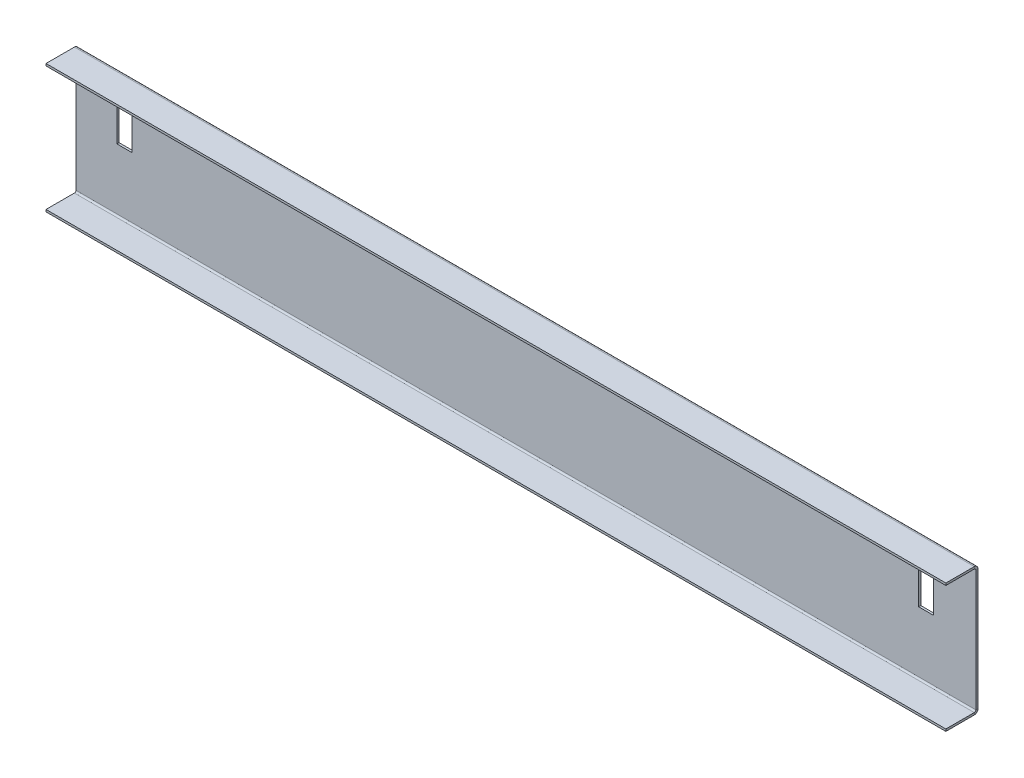
ISO-10303-21;
HEADER;
FILE_DESCRIPTION(('STEP AP214'),'2;1');
FILE_NAME('part.step','',(''),(''),'','','');
FILE_SCHEMA(('AUTOMOTIVE_DESIGN { 1 0 10303 214 1 1 1 1 }'));
ENDSEC;
DATA;
#1=APPLICATION_CONTEXT('core data for automotive mechanical design processes');
#2=APPLICATION_PROTOCOL_DEFINITION('international standard','automotive_design',2000,#1);
#3=PRODUCT_CONTEXT('',#1,'mechanical');
#4=PRODUCT('Part','Part','',(#3));
#5=PRODUCT_RELATED_PRODUCT_CATEGORY('part','',(#4));
#6=PRODUCT_DEFINITION_FORMATION('','',#4);
#7=PRODUCT_DEFINITION_CONTEXT('part definition',#1,'design');
#8=PRODUCT_DEFINITION('design','',#6,#7);
#9=PRODUCT_DEFINITION_SHAPE('','',#8);
#10=(LENGTH_UNIT() NAMED_UNIT(*) SI_UNIT(.MILLI.,.METRE.));
#11=(NAMED_UNIT(*) PLANE_ANGLE_UNIT() SI_UNIT($,.RADIAN.));
#12=(NAMED_UNIT(*) SI_UNIT($,.STERADIAN.) SOLID_ANGLE_UNIT());
#13=UNCERTAINTY_MEASURE_WITH_UNIT(LENGTH_MEASURE(1.E-05),#10,'distance_accuracy_value','');
#14=(GEOMETRIC_REPRESENTATION_CONTEXT(3) GLOBAL_UNCERTAINTY_ASSIGNED_CONTEXT((#13)) GLOBAL_UNIT_ASSIGNED_CONTEXT((#10,
#11,#12)) REPRESENTATION_CONTEXT('',''));
#15=CARTESIAN_POINT('',(0.,0.,0.));
#16=DIRECTION('',(0.,0.,1.));
#17=DIRECTION('',(1.,0.,0.));
#18=AXIS2_PLACEMENT_3D('',#15,#16,#17);
#19=CARTESIAN_POINT('',(0.,0.,-1.));
#20=DIRECTION('',(0.,0.,1.));
#21=DIRECTION('',(1.,0.,0.));
#22=AXIS2_PLACEMENT_3D('',#19,#20,#21);
#23=PLANE('',#22);
#24=DIRECTION('',(1.,0.,0.));
#25=VECTOR('',#24,1.);
#26=CARTESIAN_POINT('',(210.,-9.55751764705895,-1.00000000000003));
#27=LINE('',#26,#25);
#28=CARTESIAN_POINT('',(210.,-9.55751764705895,-1.00000000000003));
#29=VERTEX_POINT('',#28);
#30=CARTESIAN_POINT('',(-210.,-9.55751764705894,-1.));
#31=VERTEX_POINT('',#30);
#32=EDGE_CURVE('E315',#29,#31,#27,.F.);
#33=ORIENTED_EDGE('',*,*,#32,.T.);
#34=DIRECTION('',(0.,-1.,0.));
#35=VECTOR('',#34,1.);
#36=CARTESIAN_POINT('',(-210.,48.7058823529411,-1.));
#37=LINE('',#36,#35);
#38=CARTESIAN_POINT('',(-210.,46.9692823529411,-1.));
#39=VERTEX_POINT('',#38);
#40=EDGE_CURVE('E88',#39,#31,#37,.T.);
#41=ORIENTED_EDGE('',*,*,#40,.F.);
#42=DIRECTION('',(-1.,0.,0.));
#43=VECTOR('',#42,1.);
#44=CARTESIAN_POINT('',(-210.,46.9692823529411,-1.));
#45=LINE('',#44,#43);
#46=CARTESIAN_POINT('',(210.,46.9692823529411,-1.));
#47=VERTEX_POINT('',#46);
#48=EDGE_CURVE('E368',#39,#47,#45,.F.);
#49=ORIENTED_EDGE('',*,*,#48,.T.);
#50=DIRECTION('',(0.,1.,0.));
#51=VECTOR('',#50,1.);
#52=CARTESIAN_POINT('',(210.,-11.2941176470589,-1.));
#53=LINE('',#52,#51);
#54=EDGE_CURVE('E13',#29,#47,#53,.T.);
#55=ORIENTED_EDGE('',*,*,#54,.F.);
#56=EDGE_LOOP('',(#33,#41,#49,#55));
#57=FACE_BOUND('',#56,.T.);
#58=DIRECTION('',(1.,0.,0.));
#59=VECTOR('',#58,1.);
#60=CARTESIAN_POINT('',(0.,38.75,-1.00000000000003));
#61=LINE('',#60,#59);
#62=CARTESIAN_POINT('',(-190.855,38.75,-1.00000000000003));
#63=VERTEX_POINT('',#62);
#64=CARTESIAN_POINT('',(-183.855,38.75,-1.00000000000003));
#65=VERTEX_POINT('',#64);
#66=EDGE_CURVE('E267',#63,#65,#61,.T.);
#67=ORIENTED_EDGE('',*,*,#66,.F.);
#68=DIRECTION('',(0.,-1.,0.));
#69=VECTOR('',#68,1.);
#70=CARTESIAN_POINT('',(-190.855,0.,-1.00000000000003));
#71=LINE('',#70,#69);
#72=CARTESIAN_POINT('',(-190.855,18.75,-1.00000000000003));
#73=VERTEX_POINT('',#72);
#74=EDGE_CURVE('E258',#63,#73,#71,.T.);
#75=ORIENTED_EDGE('',*,*,#74,.T.);
#76=DIRECTION('',(1.,0.,0.));
#77=VECTOR('',#76,1.);
#78=CARTESIAN_POINT('',(0.,18.7500000000001,-1.00000000000003));
#79=LINE('',#78,#77);
#80=CARTESIAN_POINT('',(-183.855,18.75,-1.));
#81=VERTEX_POINT('',#80);
#82=EDGE_CURVE('E261',#73,#81,#79,.T.);
#83=ORIENTED_EDGE('',*,*,#82,.T.);
#84=DIRECTION('',(0.,-1.,0.));
#85=VECTOR('',#84,1.);
#86=CARTESIAN_POINT('',(-183.855,0.,-1.00000000000003));
#87=LINE('',#86,#85);
#88=EDGE_CURVE('E265',#65,#81,#87,.T.);
#89=ORIENTED_EDGE('',*,*,#88,.F.);
#90=EDGE_LOOP('',(#67,#75,#83,#89));
#91=FACE_BOUND('',#90,.T.);
#92=DIRECTION('',(0.,-1.,0.));
#93=VECTOR('',#92,1.);
#94=CARTESIAN_POINT('',(190.318027368843,0.,-1.00000000000003));
#95=LINE('',#94,#93);
#96=CARTESIAN_POINT('',(190.318027368843,38.75,-1.00000000000003));
#97=VERTEX_POINT('',#96);
#98=CARTESIAN_POINT('',(190.318027368843,18.75,-1.00000000000003));
#99=VERTEX_POINT('',#98);
#100=EDGE_CURVE('E227',#97,#99,#95,.T.);
#101=ORIENTED_EDGE('',*,*,#100,.F.);
#102=DIRECTION('',(1.,0.,0.));
#103=VECTOR('',#102,1.);
#104=CARTESIAN_POINT('',(0.,38.75,-1.00000000000003));
#105=LINE('',#104,#103);
#106=CARTESIAN_POINT('',(183.318027368843,38.75,-1.));
#107=VERTEX_POINT('',#106);
#108=EDGE_CURVE('E218',#107,#97,#105,.T.);
#109=ORIENTED_EDGE('',*,*,#108,.F.);
#110=DIRECTION('',(0.,-1.,0.));
#111=VECTOR('',#110,1.);
#112=CARTESIAN_POINT('',(183.318027368843,0.,-1.00000000000003));
#113=LINE('',#112,#111);
#114=CARTESIAN_POINT('',(183.318027368843,18.75,-1.00000000000003));
#115=VERTEX_POINT('',#114);
#116=EDGE_CURVE('E96',#107,#115,#113,.T.);
#117=ORIENTED_EDGE('',*,*,#116,.T.);
#118=DIRECTION('',(1.,0.,0.));
#119=VECTOR('',#118,1.);
#120=CARTESIAN_POINT('',(0.,18.75,-1.00000000000003));
#121=LINE('',#120,#119);
#122=EDGE_CURVE('E234',#115,#99,#121,.T.);
#123=ORIENTED_EDGE('',*,*,#122,.T.);
#124=EDGE_LOOP('',(#101,#109,#117,#123));
#125=FACE_BOUND('',#124,.T.);
#126=ADVANCED_FACE('F79',(#57,#91,#125),#23,.F.);
#127=CARTESIAN_POINT('',(0.,0.,0.));
#128=DIRECTION('',(0.,0.,1.));
#129=DIRECTION('',(1.,0.,0.));
#130=AXIS2_PLACEMENT_3D('',#127,#128,#129);
#131=PLANE('',#130);
#132=DIRECTION('',(0.,-1.,0.));
#133=VECTOR('',#132,1.);
#134=CARTESIAN_POINT('',(-190.855,0.,0.));
#135=LINE('',#134,#133);
#136=CARTESIAN_POINT('',(-190.855,38.75,0.));
#137=VERTEX_POINT('',#136);
#138=CARTESIAN_POINT('',(-190.855,18.75,0.));
#139=VERTEX_POINT('',#138);
#140=EDGE_CURVE('E270',#137,#139,#135,.T.);
#141=ORIENTED_EDGE('',*,*,#140,.F.);
#142=DIRECTION('',(1.,0.,0.));
#143=VECTOR('',#142,1.);
#144=CARTESIAN_POINT('',(0.,38.75,0.));
#145=LINE('',#144,#143);
#146=CARTESIAN_POINT('',(-183.855,38.75,0.));
#147=VERTEX_POINT('',#146);
#148=EDGE_CURVE('E262',#137,#147,#145,.T.);
#149=ORIENTED_EDGE('',*,*,#148,.T.);
#150=DIRECTION('',(0.,-1.,0.));
#151=VECTOR('',#150,1.);
#152=CARTESIAN_POINT('',(-183.855,0.,0.));
#153=LINE('',#152,#151);
#154=CARTESIAN_POINT('',(-183.855,18.75,0.));
#155=VERTEX_POINT('',#154);
#156=EDGE_CURVE('E274',#147,#155,#153,.T.);
#157=ORIENTED_EDGE('',*,*,#156,.T.);
#158=DIRECTION('',(1.,0.,0.));
#159=VECTOR('',#158,1.);
#160=CARTESIAN_POINT('',(0.,18.7500000000001,0.));
#161=LINE('',#160,#159);
#162=EDGE_CURVE('E272',#139,#155,#161,.T.);
#163=ORIENTED_EDGE('',*,*,#162,.F.);
#164=EDGE_LOOP('',(#141,#149,#157,#163));
#165=FACE_BOUND('',#164,.T.);
#166=DIRECTION('',(0.,-1.,0.));
#167=VECTOR('',#166,1.);
#168=CARTESIAN_POINT('',(-210.,48.7058823529411,0.));
#169=LINE('',#168,#167);
#170=CARTESIAN_POINT('',(-210.,46.9692823529411,0.));
#171=VERTEX_POINT('',#170);
#172=CARTESIAN_POINT('',(-210.,-9.55751764705895,0.));
#173=VERTEX_POINT('',#172);
#174=EDGE_CURVE('E389',#171,#173,#169,.T.);
#175=ORIENTED_EDGE('',*,*,#174,.T.);
#176=DIRECTION('',(1.,0.,0.));
#177=VECTOR('',#176,1.);
#178=CARTESIAN_POINT('',(210.,-9.55751764705895,0.));
#179=LINE('',#178,#177);
#180=CARTESIAN_POINT('',(210.,-9.55751764705895,0.));
#181=VERTEX_POINT('',#180);
#182=EDGE_CURVE('E327',#181,#173,#179,.F.);
#183=ORIENTED_EDGE('',*,*,#182,.F.);
#184=DIRECTION('',(0.,1.,0.));
#185=VECTOR('',#184,1.);
#186=CARTESIAN_POINT('',(210.,-11.2941176470589,0.));
#187=LINE('',#186,#185);
#188=CARTESIAN_POINT('',(210.,46.9692823529411,0.));
#189=VERTEX_POINT('',#188);
#190=EDGE_CURVE('E83',#181,#189,#187,.T.);
#191=ORIENTED_EDGE('',*,*,#190,.T.);
#192=DIRECTION('',(-1.,0.,0.));
#193=VECTOR('',#192,1.);
#194=CARTESIAN_POINT('',(-210.,46.9692823529411,0.));
#195=LINE('',#194,#193);
#196=EDGE_CURVE('E381',#171,#189,#195,.F.);
#197=ORIENTED_EDGE('',*,*,#196,.F.);
#198=EDGE_LOOP('',(#175,#183,#191,#197));
#199=FACE_BOUND('',#198,.T.);
#200=DIRECTION('',(1.,0.,0.));
#201=VECTOR('',#200,1.);
#202=CARTESIAN_POINT('',(0.,38.75,0.));
#203=LINE('',#202,#201);
#204=CARTESIAN_POINT('',(183.318027368843,38.75,0.));
#205=VERTEX_POINT('',#204);
#206=CARTESIAN_POINT('',(190.318027368843,38.75,0.));
#207=VERTEX_POINT('',#206);
#208=EDGE_CURVE('E247',#205,#207,#203,.T.);
#209=ORIENTED_EDGE('',*,*,#208,.T.);
#210=DIRECTION('',(0.,-1.,0.));
#211=VECTOR('',#210,1.);
#212=CARTESIAN_POINT('',(190.318027368843,0.,0.));
#213=LINE('',#212,#211);
#214=CARTESIAN_POINT('',(190.318027368843,18.75,0.));
#215=VERTEX_POINT('',#214);
#216=EDGE_CURVE('E233',#207,#215,#213,.T.);
#217=ORIENTED_EDGE('',*,*,#216,.T.);
#218=DIRECTION('',(1.,0.,0.));
#219=VECTOR('',#218,1.);
#220=CARTESIAN_POINT('',(0.,18.75,0.));
#221=LINE('',#220,#219);
#222=CARTESIAN_POINT('',(183.318027368843,18.75,0.));
#223=VERTEX_POINT('',#222);
#224=EDGE_CURVE('E238',#223,#215,#221,.T.);
#225=ORIENTED_EDGE('',*,*,#224,.F.);
#226=DIRECTION('',(0.,-1.,0.));
#227=VECTOR('',#226,1.);
#228=CARTESIAN_POINT('',(183.318027368843,0.,0.));
#229=LINE('',#228,#227);
#230=EDGE_CURVE('E241',#205,#223,#229,.T.);
#231=ORIENTED_EDGE('',*,*,#230,.F.);
#232=EDGE_LOOP('',(#209,#217,#225,#231));
#233=FACE_BOUND('',#232,.T.);
#234=ADVANCED_FACE('F398',(#165,#199,#233),#131,.T.);
#235=CARTESIAN_POINT('',(210.,-11.2941176470589,-1.));
#236=DIRECTION('',(1.,0.,0.));
#237=DIRECTION('',(0.,1.,0.));
#238=AXIS2_PLACEMENT_3D('',#235,#236,#237);
#239=PLANE('',#238);
#240=ORIENTED_EDGE('',*,*,#190,.F.);
#241=DIRECTION('',(0.,0.,-1.));
#242=VECTOR('',#241,1.);
#243=CARTESIAN_POINT('',(210.,-9.55751764705895,0.));
#244=LINE('',#243,#242);
#245=EDGE_CURVE('E321',#181,#29,#244,.T.);
#246=ORIENTED_EDGE('',*,*,#245,.T.);
#247=ORIENTED_EDGE('',*,*,#54,.T.);
#248=DIRECTION('',(0.,0.,-1.));
#249=VECTOR('',#248,1.);
#250=CARTESIAN_POINT('',(210.,46.9692823529411,0.));
#251=LINE('',#250,#249);
#252=EDGE_CURVE('E386',#189,#47,#251,.T.);
#253=ORIENTED_EDGE('',*,*,#252,.F.);
#254=EDGE_LOOP('',(#240,#246,#247,#253));
#255=FACE_BOUND('',#254,.T.);
#256=ADVANCED_FACE('F402',(#255),#239,.T.);
#257=CARTESIAN_POINT('',(-210.,48.7058823529411,-1.));
#258=DIRECTION('',(-1.,0.,0.));
#259=DIRECTION('',(0.,-1.,0.));
#260=AXIS2_PLACEMENT_3D('',#257,#258,#259);
#261=PLANE('',#260);
#262=DIRECTION('',(0.,0.,-1.));
#263=VECTOR('',#262,1.);
#264=CARTESIAN_POINT('',(-210.,-9.55751764705895,0.));
#265=LINE('',#264,#263);
#266=EDGE_CURVE('E332',#173,#31,#265,.T.);
#267=ORIENTED_EDGE('',*,*,#266,.F.);
#268=ORIENTED_EDGE('',*,*,#174,.F.);
#269=DIRECTION('',(0.,0.,-1.));
#270=VECTOR('',#269,1.);
#271=CARTESIAN_POINT('',(-210.,46.9692823529411,0.));
#272=LINE('',#271,#270);
#273=EDGE_CURVE('E375',#171,#39,#272,.T.);
#274=ORIENTED_EDGE('',*,*,#273,.T.);
#275=ORIENTED_EDGE('',*,*,#40,.T.);
#276=EDGE_LOOP('',(#267,#268,#274,#275));
#277=FACE_BOUND('',#276,.T.);
#278=ADVANCED_FACE('F81',(#277),#261,.T.);
#279=CARTESIAN_POINT('',(210.,46.9692823529411,0.736599999999996));
#280=DIRECTION('',(1.,0.,0.));
#281=DIRECTION('',(0.,0.,-1.));
#282=AXIS2_PLACEMENT_3D('',#279,#280,#281);
#283=PLANE('',#282);
#284=DIRECTION('',(0.,-1.,0.));
#285=VECTOR('',#284,1.);
#286=CARTESIAN_POINT('',(210.,48.7058823529411,0.736599999999993));
#287=LINE('',#286,#285);
#288=CARTESIAN_POINT('',(210.,47.7058823529411,0.736599999999993));
#289=VERTEX_POINT('',#288);
#290=CARTESIAN_POINT('',(210.,48.7058823529411,0.73659999999999));
#291=VERTEX_POINT('',#290);
#292=EDGE_CURVE('E335',#289,#291,#287,.F.);
#293=ORIENTED_EDGE('',*,*,#292,.F.);
#294=CARTESIAN_POINT('',(210.,46.9692823529411,0.736599999999996));
#295=DIRECTION('',(-1.,0.,0.));
#296=DIRECTION('',(0.,0.,1.));
#297=AXIS2_PLACEMENT_3D('',#294,#295,#296);
#298=CIRCLE('',#297,0.736599999999997);
#299=EDGE_CURVE('E378',#189,#289,#298,.F.);
#300=ORIENTED_EDGE('',*,*,#299,.F.);
#301=ORIENTED_EDGE('',*,*,#252,.T.);
#302=CARTESIAN_POINT('',(210.,46.9692823529411,0.736599999999996));
#303=DIRECTION('',(-1.,0.,0.));
#304=DIRECTION('',(0.,0.,1.));
#305=AXIS2_PLACEMENT_3D('',#302,#303,#304);
#306=CIRCLE('',#305,1.7366);
#307=EDGE_CURVE('E371',#47,#291,#306,.F.);
#308=ORIENTED_EDGE('',*,*,#307,.T.);
#309=EDGE_LOOP('',(#293,#300,#301,#308));
#310=FACE_BOUND('',#309,.T.);
#311=ADVANCED_FACE('F410',(#310),#283,.T.);
#312=CARTESIAN_POINT('',(-210.,46.9692823529411,0.736599999999996));
#313=DIRECTION('',(1.,0.,0.));
#314=DIRECTION('',(0.,0.,-1.));
#315=AXIS2_PLACEMENT_3D('',#312,#313,#314);
#316=PLANE('',#315);
#317=CARTESIAN_POINT('',(-210.,46.9692823529411,0.736599999999996));
#318=DIRECTION('',(-1.,0.,0.));
#319=DIRECTION('',(0.,0.,1.));
#320=AXIS2_PLACEMENT_3D('',#317,#318,#319);
#321=CIRCLE('',#320,0.736599999999997);
#322=CARTESIAN_POINT('',(-210.,47.7058823529411,0.736599999999993));
#323=VERTEX_POINT('',#322);
#324=EDGE_CURVE('E341',#323,#171,#321,.T.);
#325=ORIENTED_EDGE('',*,*,#324,.F.);
#326=DIRECTION('',(0.,-1.,0.));
#327=VECTOR('',#326,1.);
#328=CARTESIAN_POINT('',(-210.,47.7058823529411,0.73659999999999));
#329=LINE('',#328,#327);
#330=CARTESIAN_POINT('',(-210.,48.7058823529411,0.736599999999987));
#331=VERTEX_POINT('',#330);
#332=EDGE_CURVE('E361',#323,#331,#329,.F.);
#333=ORIENTED_EDGE('',*,*,#332,.T.);
#334=CARTESIAN_POINT('',(-210.,46.9692823529411,0.736599999999996));
#335=DIRECTION('',(-1.,0.,0.));
#336=DIRECTION('',(0.,0.,1.));
#337=AXIS2_PLACEMENT_3D('',#334,#335,#336);
#338=CIRCLE('',#337,1.7366);
#339=EDGE_CURVE('E372',#331,#39,#338,.T.);
#340=ORIENTED_EDGE('',*,*,#339,.T.);
#341=ORIENTED_EDGE('',*,*,#273,.F.);
#342=EDGE_LOOP('',(#325,#333,#340,#341));
#343=FACE_BOUND('',#342,.T.);
#344=ADVANCED_FACE('F431',(#343),#316,.F.);
#345=CARTESIAN_POINT('',(-210.,46.9692823529411,0.736599999999996));
#346=DIRECTION('',(-1.,0.,0.));
#347=DIRECTION('',(0.,1.,0.));
#348=AXIS2_PLACEMENT_3D('',#345,#346,#347);
#349=CYLINDRICAL_SURFACE('',#348,1.7366);
#350=ORIENTED_EDGE('',*,*,#48,.F.);
#351=ORIENTED_EDGE('',*,*,#339,.F.);
#352=DIRECTION('',(-1.,0.,0.));
#353=VECTOR('',#352,1.);
#354=CARTESIAN_POINT('',(210.,48.7058823529411,0.736599999999993));
#355=LINE('',#354,#353);
#356=EDGE_CURVE('E359',#331,#291,#355,.F.);
#357=ORIENTED_EDGE('',*,*,#356,.T.);
#358=ORIENTED_EDGE('',*,*,#307,.F.);
#359=EDGE_LOOP('',(#350,#351,#357,#358));
#360=FACE_BOUND('',#359,.T.);
#361=ADVANCED_FACE('F441',(#360),#349,.T.);
#362=CARTESIAN_POINT('',(-210.,46.9692823529411,0.736599999999996));
#363=DIRECTION('',(-1.,0.,0.));
#364=DIRECTION('',(0.,1.,0.));
#365=AXIS2_PLACEMENT_3D('',#362,#363,#364);
#366=CYLINDRICAL_SURFACE('',#365,0.736599999999997);
#367=ORIENTED_EDGE('',*,*,#196,.T.);
#368=ORIENTED_EDGE('',*,*,#299,.T.);
#369=DIRECTION('',(-1.,0.,0.));
#370=VECTOR('',#369,1.);
#371=CARTESIAN_POINT('',(210.,47.7058823529411,0.736599999999997));
#372=LINE('',#371,#370);
#373=EDGE_CURVE('E364',#289,#323,#372,.T.);
#374=ORIENTED_EDGE('',*,*,#373,.T.);
#375=ORIENTED_EDGE('',*,*,#324,.T.);
#376=EDGE_LOOP('',(#367,#368,#374,#375));
#377=FACE_BOUND('',#376,.T.);
#378=ADVANCED_FACE('F407',(#377),#366,.F.);
#379=CARTESIAN_POINT('',(-210.,48.7058823529411,14.));
#380=DIRECTION('',(1.,0.,0.));
#381=DIRECTION('',(0.,0.,-1.));
#382=AXIS2_PLACEMENT_3D('',#379,#380,#381);
#383=PLANE('',#382);
#384=ORIENTED_EDGE('',*,*,#332,.F.);
#385=DIRECTION('',(0.,0.,-1.));
#386=VECTOR('',#385,1.);
#387=CARTESIAN_POINT('',(-210.,47.7058823529411,14.));
#388=LINE('',#387,#386);
#389=CARTESIAN_POINT('',(-210.,47.7058823529411,14.));
#390=VERTEX_POINT('',#389);
#391=EDGE_CURVE('E357',#323,#390,#388,.F.);
#392=ORIENTED_EDGE('',*,*,#391,.T.);
#393=DIRECTION('',(0.,-1.,0.));
#394=VECTOR('',#393,1.);
#395=CARTESIAN_POINT('',(-210.,48.7058823529411,14.));
#396=LINE('',#395,#394);
#397=CARTESIAN_POINT('',(-210.,48.7058823529411,14.));
#398=VERTEX_POINT('',#397);
#399=EDGE_CURVE('E338',#398,#390,#396,.T.);
#400=ORIENTED_EDGE('',*,*,#399,.F.);
#401=DIRECTION('',(0.,0.,1.));
#402=VECTOR('',#401,1.);
#403=CARTESIAN_POINT('',(-210.,48.7058823529411,-1.72473956410466E-13));
#404=LINE('',#403,#402);
#405=EDGE_CURVE('E350',#331,#398,#404,.T.);
#406=ORIENTED_EDGE('',*,*,#405,.F.);
#407=EDGE_LOOP('',(#384,#392,#400,#406));
#408=FACE_BOUND('',#407,.T.);
#409=ADVANCED_FACE('F433',(#408),#383,.F.);
#410=CARTESIAN_POINT('',(210.,48.7058823529411,0.));
#411=DIRECTION('',(-1.,0.,0.));
#412=DIRECTION('',(0.,0.,1.));
#413=AXIS2_PLACEMENT_3D('',#410,#411,#412);
#414=PLANE('',#413);
#415=ORIENTED_EDGE('',*,*,#292,.T.);
#416=DIRECTION('',(0.,0.,-1.));
#417=VECTOR('',#416,1.);
#418=CARTESIAN_POINT('',(210.,48.7058823529411,-1.72473956410466E-13));
#419=LINE('',#418,#417);
#420=CARTESIAN_POINT('',(210.,48.7058823529411,14.));
#421=VERTEX_POINT('',#420);
#422=EDGE_CURVE('E345',#421,#291,#419,.T.);
#423=ORIENTED_EDGE('',*,*,#422,.F.);
#424=DIRECTION('',(0.,-1.,0.));
#425=VECTOR('',#424,1.);
#426=CARTESIAN_POINT('',(210.,48.7058823529411,14.));
#427=LINE('',#426,#425);
#428=CARTESIAN_POINT('',(210.,47.7058823529411,14.));
#429=VERTEX_POINT('',#428);
#430=EDGE_CURVE('E342',#421,#429,#427,.T.);
#431=ORIENTED_EDGE('',*,*,#430,.T.);
#432=DIRECTION('',(0.,0.,1.));
#433=VECTOR('',#432,1.);
#434=CARTESIAN_POINT('',(210.,47.7058823529411,0.));
#435=LINE('',#434,#433);
#436=EDGE_CURVE('E352',#429,#289,#435,.F.);
#437=ORIENTED_EDGE('',*,*,#436,.T.);
#438=EDGE_LOOP('',(#415,#423,#431,#437));
#439=FACE_BOUND('',#438,.T.);
#440=ADVANCED_FACE('F413',(#439),#414,.F.);
#441=CARTESIAN_POINT('',(0.,48.7058823529411,-1.72473956410466E-13));
#442=DIRECTION('',(0.,-1.,0.));
#443=DIRECTION('',(0.,0.,-1.));
#444=AXIS2_PLACEMENT_3D('',#441,#442,#443);
#445=PLANE('',#444);
#446=ORIENTED_EDGE('',*,*,#356,.F.);
#447=ORIENTED_EDGE('',*,*,#405,.T.);
#448=DIRECTION('',(1.,0.,0.));
#449=VECTOR('',#448,1.);
#450=CARTESIAN_POINT('',(0.,48.7058823529411,14.));
#451=LINE('',#450,#449);
#452=EDGE_CURVE('E348',#398,#421,#451,.T.);
#453=ORIENTED_EDGE('',*,*,#452,.T.);
#454=ORIENTED_EDGE('',*,*,#422,.T.);
#455=EDGE_LOOP('',(#446,#447,#453,#454));
#456=FACE_BOUND('',#455,.T.);
#457=ADVANCED_FACE('F417',(#456),#445,.F.);
#458=CARTESIAN_POINT('',(0.,47.7058823529411,-1.68982475071623E-13));
#459=DIRECTION('',(0.,-1.,0.));
#460=DIRECTION('',(0.,0.,-1.));
#461=AXIS2_PLACEMENT_3D('',#458,#459,#460);
#462=PLANE('',#461);
#463=ORIENTED_EDGE('',*,*,#391,.F.);
#464=ORIENTED_EDGE('',*,*,#373,.F.);
#465=ORIENTED_EDGE('',*,*,#436,.F.);
#466=DIRECTION('',(-1.,0.,0.));
#467=VECTOR('',#466,1.);
#468=CARTESIAN_POINT('',(210.,47.7058823529411,14.));
#469=LINE('',#468,#467);
#470=EDGE_CURVE('E355',#390,#429,#469,.F.);
#471=ORIENTED_EDGE('',*,*,#470,.F.);
#472=EDGE_LOOP('',(#463,#464,#465,#471));
#473=FACE_BOUND('',#472,.T.);
#474=ADVANCED_FACE('F427',(#473),#462,.T.);
#475=CARTESIAN_POINT('',(210.,48.7058823529411,14.));
#476=DIRECTION('',(0.,0.,-1.));
#477=DIRECTION('',(0.,1.,0.));
#478=AXIS2_PLACEMENT_3D('',#475,#476,#477);
#479=PLANE('',#478);
#480=ORIENTED_EDGE('',*,*,#470,.T.);
#481=ORIENTED_EDGE('',*,*,#430,.F.);
#482=ORIENTED_EDGE('',*,*,#452,.F.);
#483=ORIENTED_EDGE('',*,*,#399,.T.);
#484=EDGE_LOOP('',(#480,#481,#482,#483));
#485=FACE_BOUND('',#484,.T.);
#486=ADVANCED_FACE('F423',(#485),#479,.F.);
#487=CARTESIAN_POINT('',(-210.,-9.55751764705895,0.736600000000005));
#488=DIRECTION('',(-1.,0.,0.));
#489=DIRECTION('',(0.,0.,1.));
#490=AXIS2_PLACEMENT_3D('',#487,#488,#489);
#491=PLANE('',#490);
#492=DIRECTION('',(0.,1.,0.));
#493=VECTOR('',#492,1.);
#494=CARTESIAN_POINT('',(-210.,-11.2941176470589,0.736599999999993));
#495=LINE('',#494,#493);
#496=CARTESIAN_POINT('',(-210.,-10.2941176470589,0.736600000000003));
#497=VERTEX_POINT('',#496);
#498=CARTESIAN_POINT('',(-210.,-11.2941176470589,0.736599999999999));
#499=VERTEX_POINT('',#498);
#500=EDGE_CURVE('E254',#497,#499,#495,.F.);
#501=ORIENTED_EDGE('',*,*,#500,.F.);
#502=CARTESIAN_POINT('',(-210.,-9.55751764705895,0.736600000000005));
#503=DIRECTION('',(1.,0.,0.));
#504=DIRECTION('',(0.,0.,-1.));
#505=AXIS2_PLACEMENT_3D('',#502,#503,#504);
#506=CIRCLE('',#505,0.7366);
#507=EDGE_CURVE('E324',#173,#497,#506,.F.);
#508=ORIENTED_EDGE('',*,*,#507,.F.);
#509=ORIENTED_EDGE('',*,*,#266,.T.);
#510=CARTESIAN_POINT('',(-210.,-9.55751764705895,0.736600000000005));
#511=DIRECTION('',(1.,0.,0.));
#512=DIRECTION('',(0.,0.,-1.));
#513=AXIS2_PLACEMENT_3D('',#510,#511,#512);
#514=CIRCLE('',#513,1.7366);
#515=EDGE_CURVE('E317',#31,#499,#514,.F.);
#516=ORIENTED_EDGE('',*,*,#515,.T.);
#517=EDGE_LOOP('',(#501,#508,#509,#516));
#518=FACE_BOUND('',#517,.T.);
#519=ADVANCED_FACE('F467',(#518),#491,.T.);
#520=CARTESIAN_POINT('',(210.,-9.55751764705895,0.736599999999974));
#521=DIRECTION('',(-1.,0.,0.));
#522=DIRECTION('',(0.,0.,1.));
#523=AXIS2_PLACEMENT_3D('',#520,#521,#522);
#524=PLANE('',#523);
#525=CARTESIAN_POINT('',(210.,-9.55751764705895,0.736599999999974));
#526=DIRECTION('',(1.,0.,0.));
#527=DIRECTION('',(0.,0.,-1.));
#528=AXIS2_PLACEMENT_3D('',#525,#526,#527);
#529=CIRCLE('',#528,0.7366);
#530=CARTESIAN_POINT('',(210.,-10.2941176470589,0.736599999999972));
#531=VERTEX_POINT('',#530);
#532=EDGE_CURVE('E288',#531,#181,#529,.T.);
#533=ORIENTED_EDGE('',*,*,#532,.F.);
#534=DIRECTION('',(0.,1.,0.));
#535=VECTOR('',#534,1.);
#536=CARTESIAN_POINT('',(210.,-10.2941176470589,0.736599999999978));
#537=LINE('',#536,#535);
#538=CARTESIAN_POINT('',(210.,-11.2941176470589,0.736599999999974));
#539=VERTEX_POINT('',#538);
#540=EDGE_CURVE('E308',#531,#539,#537,.F.);
#541=ORIENTED_EDGE('',*,*,#540,.T.);
#542=CARTESIAN_POINT('',(210.,-9.55751764705895,0.736599999999974));
#543=DIRECTION('',(1.,0.,0.));
#544=DIRECTION('',(0.,0.,-1.));
#545=AXIS2_PLACEMENT_3D('',#542,#543,#544);
#546=CIRCLE('',#545,1.7366);
#547=EDGE_CURVE('E318',#539,#29,#546,.T.);
#548=ORIENTED_EDGE('',*,*,#547,.T.);
#549=ORIENTED_EDGE('',*,*,#245,.F.);
#550=EDGE_LOOP('',(#533,#541,#548,#549));
#551=FACE_BOUND('',#550,.T.);
#552=ADVANCED_FACE('F512',(#551),#524,.F.);
#553=CARTESIAN_POINT('',(210.,-9.55751764705895,0.736599999999974));
#554=DIRECTION('',(1.,0.,0.));
#555=DIRECTION('',(0.,-1.,0.));
#556=AXIS2_PLACEMENT_3D('',#553,#554,#555);
#557=CYLINDRICAL_SURFACE('',#556,1.7366);
#558=ORIENTED_EDGE('',*,*,#32,.F.);
#559=ORIENTED_EDGE('',*,*,#547,.F.);
#560=DIRECTION('',(1.,0.,0.));
#561=VECTOR('',#560,1.);
#562=CARTESIAN_POINT('',(-210.,-11.2941176470589,0.736599999999993));
#563=LINE('',#562,#561);
#564=EDGE_CURVE('E306',#539,#499,#563,.F.);
#565=ORIENTED_EDGE('',*,*,#564,.T.);
#566=ORIENTED_EDGE('',*,*,#515,.F.);
#567=EDGE_LOOP('',(#558,#559,#565,#566));
#568=FACE_BOUND('',#567,.T.);
#569=ADVANCED_FACE('F470',(#568),#557,.T.);
#570=CARTESIAN_POINT('',(210.,-9.55751764705895,0.736599999999974));
#571=DIRECTION('',(1.,0.,0.));
#572=DIRECTION('',(0.,-1.,0.));
#573=AXIS2_PLACEMENT_3D('',#570,#571,#572);
#574=CYLINDRICAL_SURFACE('',#573,0.7366);
#575=ORIENTED_EDGE('',*,*,#182,.T.);
#576=ORIENTED_EDGE('',*,*,#507,.T.);
#577=DIRECTION('',(1.,0.,0.));
#578=VECTOR('',#577,1.);
#579=CARTESIAN_POINT('',(-210.,-10.2941176470589,0.736599999999997));
#580=LINE('',#579,#578);
#581=EDGE_CURVE('E311',#497,#531,#580,.T.);
#582=ORIENTED_EDGE('',*,*,#581,.T.);
#583=ORIENTED_EDGE('',*,*,#532,.T.);
#584=EDGE_LOOP('',(#575,#576,#582,#583));
#585=FACE_BOUND('',#584,.T.);
#586=ADVANCED_FACE('F491',(#585),#574,.F.);
#587=CARTESIAN_POINT('',(-210.,-11.2941176470589,0.));
#588=DIRECTION('',(1.,0.,0.));
#589=DIRECTION('',(0.,0.,-1.));
#590=AXIS2_PLACEMENT_3D('',#587,#588,#589);
#591=PLANE('',#590);
#592=ORIENTED_EDGE('',*,*,#500,.T.);
#593=DIRECTION('',(0.,0.,-1.));
#594=VECTOR('',#593,1.);
#595=CARTESIAN_POINT('',(-210.,-11.2941176470589,0.));
#596=LINE('',#595,#594);
#597=CARTESIAN_POINT('',(-210.,-11.294117647059,14.));
#598=VERTEX_POINT('',#597);
#599=EDGE_CURVE('E296',#598,#499,#596,.T.);
#600=ORIENTED_EDGE('',*,*,#599,.F.);
#601=DIRECTION('',(0.,1.,0.));
#602=VECTOR('',#601,1.);
#603=CARTESIAN_POINT('',(-210.,-11.294117647059,14.));
#604=LINE('',#603,#602);
#605=CARTESIAN_POINT('',(-210.,-10.294117647059,14.));
#606=VERTEX_POINT('',#605);
#607=EDGE_CURVE('E289',#598,#606,#604,.T.);
#608=ORIENTED_EDGE('',*,*,#607,.T.);
#609=DIRECTION('',(0.,0.,1.));
#610=VECTOR('',#609,1.);
#611=CARTESIAN_POINT('',(-210.,-10.2941176470589,0.));
#612=LINE('',#611,#610);
#613=EDGE_CURVE('E303',#606,#497,#612,.F.);
#614=ORIENTED_EDGE('',*,*,#613,.T.);
#615=EDGE_LOOP('',(#592,#600,#608,#614));
#616=FACE_BOUND('',#615,.T.);
#617=ADVANCED_FACE('F488',(#616),#591,.F.);
#618=CARTESIAN_POINT('',(210.,-11.294117647059,14.));
#619=DIRECTION('',(-1.,0.,0.));
#620=DIRECTION('',(0.,0.,1.));
#621=AXIS2_PLACEMENT_3D('',#618,#619,#620);
#622=PLANE('',#621);
#623=ORIENTED_EDGE('',*,*,#540,.F.);
#624=DIRECTION('',(0.,0.,-1.));
#625=VECTOR('',#624,1.);
#626=CARTESIAN_POINT('',(210.,-10.294117647059,14.));
#627=LINE('',#626,#625);
#628=CARTESIAN_POINT('',(210.,-10.294117647059,14.));
#629=VERTEX_POINT('',#628);
#630=EDGE_CURVE('E301',#531,#629,#627,.F.);
#631=ORIENTED_EDGE('',*,*,#630,.T.);
#632=DIRECTION('',(0.,1.,0.));
#633=VECTOR('',#632,1.);
#634=CARTESIAN_POINT('',(210.,-11.294117647059,14.));
#635=LINE('',#634,#633);
#636=CARTESIAN_POINT('',(210.,-11.294117647059,14.));
#637=VERTEX_POINT('',#636);
#638=EDGE_CURVE('E285',#637,#629,#635,.T.);
#639=ORIENTED_EDGE('',*,*,#638,.F.);
#640=DIRECTION('',(0.,0.,1.));
#641=VECTOR('',#640,1.);
#642=CARTESIAN_POINT('',(210.,-11.2941176470589,0.));
#643=LINE('',#642,#641);
#644=EDGE_CURVE('E294',#539,#637,#643,.T.);
#645=ORIENTED_EDGE('',*,*,#644,.F.);
#646=EDGE_LOOP('',(#623,#631,#639,#645));
#647=FACE_BOUND('',#646,.T.);
#648=ADVANCED_FACE('F479',(#647),#622,.F.);
#649=CARTESIAN_POINT('',(0.,-11.2941176470589,0.));
#650=DIRECTION('',(0.,1.,0.));
#651=DIRECTION('',(0.,0.,1.));
#652=AXIS2_PLACEMENT_3D('',#649,#650,#651);
#653=PLANE('',#652);
#654=ORIENTED_EDGE('',*,*,#564,.F.);
#655=ORIENTED_EDGE('',*,*,#644,.T.);
#656=DIRECTION('',(-1.,0.,0.));
#657=VECTOR('',#656,1.);
#658=CARTESIAN_POINT('',(0.,-11.294117647059,14.));
#659=LINE('',#658,#657);
#660=EDGE_CURVE('E292',#637,#598,#659,.T.);
#661=ORIENTED_EDGE('',*,*,#660,.T.);
#662=ORIENTED_EDGE('',*,*,#599,.T.);
#663=EDGE_LOOP('',(#654,#655,#661,#662));
#664=FACE_BOUND('',#663,.T.);
#665=ADVANCED_FACE('F474',(#664),#653,.F.);
#666=CARTESIAN_POINT('',(0.,-10.2941176470589,0.));
#667=DIRECTION('',(0.,1.,0.));
#668=DIRECTION('',(0.,0.,1.));
#669=AXIS2_PLACEMENT_3D('',#666,#667,#668);
#670=PLANE('',#669);
#671=ORIENTED_EDGE('',*,*,#630,.F.);
#672=ORIENTED_EDGE('',*,*,#581,.F.);
#673=ORIENTED_EDGE('',*,*,#613,.F.);
#674=DIRECTION('',(1.,0.,0.));
#675=VECTOR('',#674,1.);
#676=CARTESIAN_POINT('',(-210.,-10.294117647059,14.));
#677=LINE('',#676,#675);
#678=EDGE_CURVE('E299',#629,#606,#677,.F.);
#679=ORIENTED_EDGE('',*,*,#678,.F.);
#680=EDGE_LOOP('',(#671,#672,#673,#679));
#681=FACE_BOUND('',#680,.T.);
#682=ADVANCED_FACE('F494',(#681),#670,.T.);
#683=CARTESIAN_POINT('',(-210.,-11.294117647059,14.));
#684=DIRECTION('',(0.,0.,-1.));
#685=DIRECTION('',(0.,1.,0.));
#686=AXIS2_PLACEMENT_3D('',#683,#684,#685);
#687=PLANE('',#686);
#688=ORIENTED_EDGE('',*,*,#678,.T.);
#689=ORIENTED_EDGE('',*,*,#607,.F.);
#690=ORIENTED_EDGE('',*,*,#660,.F.);
#691=ORIENTED_EDGE('',*,*,#638,.T.);
#692=EDGE_LOOP('',(#688,#689,#690,#691));
#693=FACE_BOUND('',#692,.T.);
#694=ADVANCED_FACE('F485',(#693),#687,.F.);
#695=CARTESIAN_POINT('',(-190.855,0.,-1.00000000000003));
#696=DIRECTION('',(-1.,0.,0.));
#697=DIRECTION('',(0.,0.,1.));
#698=AXIS2_PLACEMENT_3D('',#695,#696,#697);
#699=PLANE('',#698);
#700=ORIENTED_EDGE('',*,*,#140,.T.);
#701=DIRECTION('',(0.,0.,1.));
#702=VECTOR('',#701,1.);
#703=CARTESIAN_POINT('',(-190.855,18.75,-1.00000000000003));
#704=LINE('',#703,#702);
#705=EDGE_CURVE('E269',#73,#139,#704,.T.);
#706=ORIENTED_EDGE('',*,*,#705,.F.);
#707=ORIENTED_EDGE('',*,*,#74,.F.);
#708=DIRECTION('',(0.,0.,1.));
#709=VECTOR('',#708,1.);
#710=CARTESIAN_POINT('',(-190.855,38.75,-1.00000000000003));
#711=LINE('',#710,#709);
#712=EDGE_CURVE('E248',#63,#137,#711,.T.);
#713=ORIENTED_EDGE('',*,*,#712,.T.);
#714=EDGE_LOOP('',(#700,#706,#707,#713));
#715=FACE_BOUND('',#714,.T.);
#716=ADVANCED_FACE('F501',(#715),#699,.F.);
#717=CARTESIAN_POINT('',(0.,38.75,-1.00000000000003));
#718=DIRECTION('',(0.,-1.,0.));
#719=DIRECTION('',(0.,0.,-1.));
#720=AXIS2_PLACEMENT_3D('',#717,#718,#719);
#721=PLANE('',#720);
#722=ORIENTED_EDGE('',*,*,#148,.F.);
#723=ORIENTED_EDGE('',*,*,#712,.F.);
#724=ORIENTED_EDGE('',*,*,#66,.T.);
#725=DIRECTION('',(0.,0.,1.));
#726=VECTOR('',#725,1.);
#727=CARTESIAN_POINT('',(-183.855,38.75,-1.00000000000003));
#728=LINE('',#727,#726);
#729=EDGE_CURVE('E280',#65,#147,#728,.T.);
#730=ORIENTED_EDGE('',*,*,#729,.T.);
#731=EDGE_LOOP('',(#722,#723,#724,#730));
#732=FACE_BOUND('',#731,.T.);
#733=ADVANCED_FACE('F589',(#732),#721,.T.);
#734=CARTESIAN_POINT('',(-183.855,0.,-1.00000000000003));
#735=DIRECTION('',(-1.,0.,0.));
#736=DIRECTION('',(0.,0.,1.));
#737=AXIS2_PLACEMENT_3D('',#734,#735,#736);
#738=PLANE('',#737);
#739=ORIENTED_EDGE('',*,*,#156,.F.);
#740=ORIENTED_EDGE('',*,*,#729,.F.);
#741=ORIENTED_EDGE('',*,*,#88,.T.);
#742=DIRECTION('',(0.,0.,1.));
#743=VECTOR('',#742,1.);
#744=CARTESIAN_POINT('',(-183.855,18.75,-1.00000000000003));
#745=LINE('',#744,#743);
#746=EDGE_CURVE('E104',#81,#155,#745,.T.);
#747=ORIENTED_EDGE('',*,*,#746,.T.);
#748=EDGE_LOOP('',(#739,#740,#741,#747));
#749=FACE_BOUND('',#748,.T.);
#750=ADVANCED_FACE('F599',(#749),#738,.T.);
#751=CARTESIAN_POINT('',(0.,18.7500000000001,-1.00000000000003));
#752=DIRECTION('',(0.,-1.,0.));
#753=DIRECTION('',(1.,0.,0.));
#754=AXIS2_PLACEMENT_3D('',#751,#752,#753);
#755=PLANE('',#754);
#756=ORIENTED_EDGE('',*,*,#162,.T.);
#757=ORIENTED_EDGE('',*,*,#746,.F.);
#758=ORIENTED_EDGE('',*,*,#82,.F.);
#759=ORIENTED_EDGE('',*,*,#705,.T.);
#760=EDGE_LOOP('',(#756,#757,#758,#759));
#761=FACE_BOUND('',#760,.T.);
#762=ADVANCED_FACE('F611',(#761),#755,.F.);
#763=CARTESIAN_POINT('',(190.318027368843,0.,-1.00000000000003));
#764=DIRECTION('',(-1.,0.,0.));
#765=DIRECTION('',(0.,0.,1.));
#766=AXIS2_PLACEMENT_3D('',#763,#764,#765);
#767=PLANE('',#766);
#768=ORIENTED_EDGE('',*,*,#216,.F.);
#769=DIRECTION('',(0.,0.,1.));
#770=VECTOR('',#769,1.);
#771=CARTESIAN_POINT('',(190.318027368843,38.75,-1.00000000000003));
#772=LINE('',#771,#770);
#773=EDGE_CURVE('E222',#97,#207,#772,.T.);
#774=ORIENTED_EDGE('',*,*,#773,.F.);
#775=ORIENTED_EDGE('',*,*,#100,.T.);
#776=DIRECTION('',(0.,0.,1.));
#777=VECTOR('',#776,1.);
#778=CARTESIAN_POINT('',(190.318027368843,18.75,-1.00000000000003));
#779=LINE('',#778,#777);
#780=EDGE_CURVE('E252',#99,#215,#779,.T.);
#781=ORIENTED_EDGE('',*,*,#780,.T.);
#782=EDGE_LOOP('',(#768,#774,#775,#781));
#783=FACE_BOUND('',#782,.T.);
#784=ADVANCED_FACE('F230',(#783),#767,.T.);
#785=CARTESIAN_POINT('',(0.,18.75,-1.00000000000003));
#786=DIRECTION('',(0.,-1.,0.));
#787=DIRECTION('',(0.,0.,-1.));
#788=AXIS2_PLACEMENT_3D('',#785,#786,#787);
#789=PLANE('',#788);
#790=ORIENTED_EDGE('',*,*,#224,.T.);
#791=ORIENTED_EDGE('',*,*,#780,.F.);
#792=ORIENTED_EDGE('',*,*,#122,.F.);
#793=DIRECTION('',(0.,0.,1.));
#794=VECTOR('',#793,1.);
#795=CARTESIAN_POINT('',(183.318027368843,18.75,-1.00000000000003));
#796=LINE('',#795,#794);
#797=EDGE_CURVE('E255',#115,#223,#796,.T.);
#798=ORIENTED_EDGE('',*,*,#797,.T.);
#799=EDGE_LOOP('',(#790,#791,#792,#798));
#800=FACE_BOUND('',#799,.T.);
#801=ADVANCED_FACE('F630',(#800),#789,.F.);
#802=CARTESIAN_POINT('',(183.318027368843,0.,-1.00000000000003));
#803=DIRECTION('',(-1.,0.,0.));
#804=DIRECTION('',(0.,0.,1.));
#805=AXIS2_PLACEMENT_3D('',#802,#803,#804);
#806=PLANE('',#805);
#807=ORIENTED_EDGE('',*,*,#230,.T.);
#808=ORIENTED_EDGE('',*,*,#797,.F.);
#809=ORIENTED_EDGE('',*,*,#116,.F.);
#810=DIRECTION('',(0.,0.,1.));
#811=VECTOR('',#810,1.);
#812=CARTESIAN_POINT('',(183.318027368843,38.75,-1.00000000000003));
#813=LINE('',#812,#811);
#814=EDGE_CURVE('E224',#107,#205,#813,.T.);
#815=ORIENTED_EDGE('',*,*,#814,.T.);
#816=EDGE_LOOP('',(#807,#808,#809,#815));
#817=FACE_BOUND('',#816,.T.);
#818=ADVANCED_FACE('F640',(#817),#806,.F.);
#819=CARTESIAN_POINT('',(0.,38.75,-1.00000000000003));
#820=DIRECTION('',(0.,-1.,0.));
#821=DIRECTION('',(0.,0.,-1.));
#822=AXIS2_PLACEMENT_3D('',#819,#820,#821);
#823=PLANE('',#822);
#824=ORIENTED_EDGE('',*,*,#208,.F.);
#825=ORIENTED_EDGE('',*,*,#814,.F.);
#826=ORIENTED_EDGE('',*,*,#108,.T.);
#827=ORIENTED_EDGE('',*,*,#773,.T.);
#828=EDGE_LOOP('',(#824,#825,#826,#827));
#829=FACE_BOUND('',#828,.T.);
#830=ADVANCED_FACE('F221',(#829),#823,.T.);
#831=CLOSED_SHELL('',(#126,#234,#256,#278,#311,#344,#361,#378,#409,#440,#457,#474,#486,#519,
#552,#569,#586,#617,#648,#665,#682,#694,#716,#733,#750,#762,#784,#801,#818,#830));
#832=MANIFOLD_SOLID_BREP('B2',#831);
#833=ADVANCED_BREP_SHAPE_REPRESENTATION('',(#18,#832),#14);
#834=SHAPE_DEFINITION_REPRESENTATION(#9,#833);
ENDSEC;
END-ISO-10303-21;
